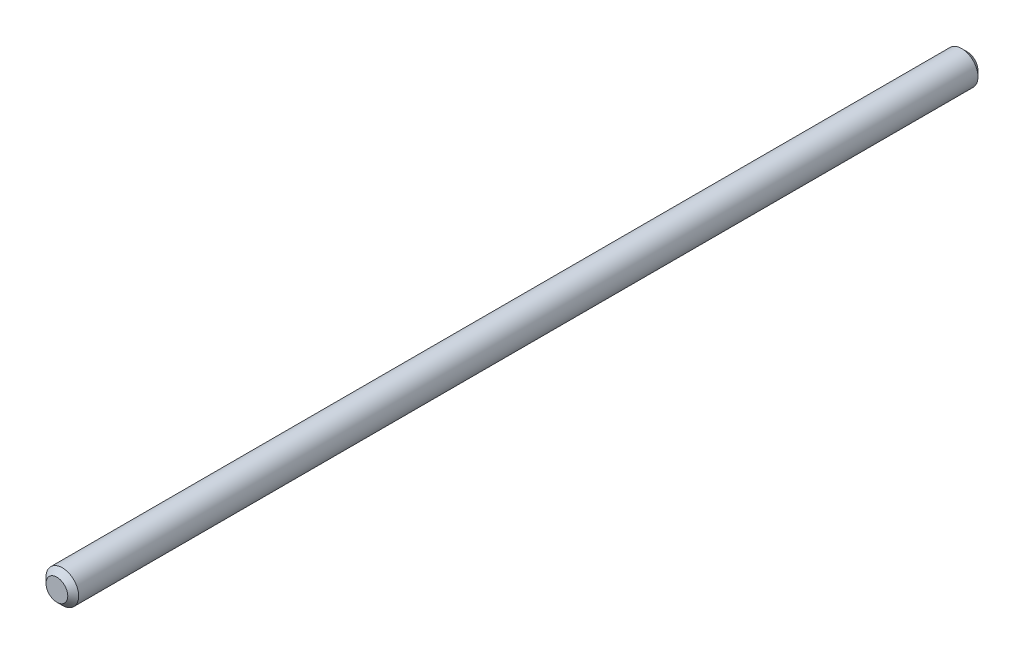
ISO-10303-21;
HEADER;
FILE_DESCRIPTION(('STEP AP214'),'2;1');
FILE_NAME('part.step','',(''),(''),'','','');
FILE_SCHEMA(('AUTOMOTIVE_DESIGN { 1 0 10303 214 1 1 1 1 }'));
ENDSEC;
DATA;
#1=APPLICATION_CONTEXT('core data for automotive mechanical design processes');
#2=APPLICATION_PROTOCOL_DEFINITION('international standard','automotive_design',2000,#1);
#3=PRODUCT_CONTEXT('',#1,'mechanical');
#4=PRODUCT('Part','Part','',(#3));
#5=PRODUCT_RELATED_PRODUCT_CATEGORY('part','',(#4));
#6=PRODUCT_DEFINITION_FORMATION('','',#4);
#7=PRODUCT_DEFINITION_CONTEXT('part definition',#1,'design');
#8=PRODUCT_DEFINITION('design','',#6,#7);
#9=PRODUCT_DEFINITION_SHAPE('','',#8);
#10=(LENGTH_UNIT() NAMED_UNIT(*) SI_UNIT(.MILLI.,.METRE.));
#11=(NAMED_UNIT(*) PLANE_ANGLE_UNIT() SI_UNIT($,.RADIAN.));
#12=(NAMED_UNIT(*) SI_UNIT($,.STERADIAN.) SOLID_ANGLE_UNIT());
#13=UNCERTAINTY_MEASURE_WITH_UNIT(LENGTH_MEASURE(1.E-05),#10,'distance_accuracy_value','');
#14=(GEOMETRIC_REPRESENTATION_CONTEXT(3) GLOBAL_UNCERTAINTY_ASSIGNED_CONTEXT((#13)) GLOBAL_UNIT_ASSIGNED_CONTEXT((#10,
#11,#12)) REPRESENTATION_CONTEXT('',''));
#15=CARTESIAN_POINT('',(0.,0.,0.));
#16=DIRECTION('',(0.,0.,1.));
#17=DIRECTION('',(1.,0.,0.));
#18=AXIS2_PLACEMENT_3D('',#15,#16,#17);
#19=CARTESIAN_POINT('',(0.,0.,83.6));
#20=DIRECTION('',(0.,0.,-1.));
#21=DIRECTION('',(-1.,0.,0.));
#22=AXIS2_PLACEMENT_3D('',#19,#20,#21);
#23=CYLINDRICAL_SURFACE('',#22,1.5);
#24=CARTESIAN_POINT('',(0.,0.,0.5));
#25=DIRECTION('',(0.,0.,1.));
#26=DIRECTION('',(1.,0.,0.));
#27=AXIS2_PLACEMENT_3D('',#24,#25,#26);
#28=CIRCLE('',#27,1.5);
#29=CARTESIAN_POINT('',(1.5,0.,0.5));
#30=VERTEX_POINT('',#29);
#31=EDGE_CURVE('E34',#30,#30,#28,.T.);
#32=ORIENTED_EDGE('',*,*,#31,.T.);
#33=EDGE_LOOP('',(#32));
#34=FACE_BOUND('',#33,.T.);
#35=CARTESIAN_POINT('',(0.,0.,83.1));
#36=DIRECTION('',(0.,0.,1.));
#37=DIRECTION('',(1.,0.,0.));
#38=AXIS2_PLACEMENT_3D('',#35,#36,#37);
#39=CIRCLE('',#38,1.5);
#40=CARTESIAN_POINT('',(1.5,0.,83.1));
#41=VERTEX_POINT('',#40);
#42=EDGE_CURVE('E38',#41,#41,#39,.F.);
#43=ORIENTED_EDGE('',*,*,#42,.T.);
#44=EDGE_LOOP('',(#43));
#45=FACE_BOUND('',#44,.T.);
#46=ADVANCED_FACE('F24',(#34,#45),#23,.T.);
#47=CARTESIAN_POINT('',(0.,0.,83.6));
#48=DIRECTION('',(0.,0.,1.));
#49=DIRECTION('',(1.,0.,0.));
#50=AXIS2_PLACEMENT_3D('',#47,#48,#49);
#51=PLANE('',#50);
#52=CARTESIAN_POINT('',(0.,0.,83.6));
#53=DIRECTION('',(0.,0.,1.));
#54=DIRECTION('',(1.,0.,0.));
#55=AXIS2_PLACEMENT_3D('',#52,#53,#54);
#56=CIRCLE('',#55,1.);
#57=CARTESIAN_POINT('',(1.,0.,83.6));
#58=VERTEX_POINT('',#57);
#59=EDGE_CURVE('E10',#58,#58,#56,.T.);
#60=ORIENTED_EDGE('',*,*,#59,.T.);
#61=EDGE_LOOP('',(#60));
#62=FACE_BOUND('',#61,.T.);
#63=ADVANCED_FACE('F57',(#62),#51,.T.);
#64=CARTESIAN_POINT('',(0.,0.,0.));
#65=DIRECTION('',(0.,0.,1.));
#66=DIRECTION('',(1.,0.,0.));
#67=AXIS2_PLACEMENT_3D('',#64,#65,#66);
#68=PLANE('',#67);
#69=CARTESIAN_POINT('',(0.,0.,0.));
#70=DIRECTION('',(0.,0.,1.));
#71=DIRECTION('',(1.,0.,0.));
#72=AXIS2_PLACEMENT_3D('',#69,#70,#71);
#73=CIRCLE('',#72,1.);
#74=CARTESIAN_POINT('',(1.,0.,0.));
#75=VERTEX_POINT('',#74);
#76=EDGE_CURVE('E30',#75,#75,#73,.F.);
#77=ORIENTED_EDGE('',*,*,#76,.T.);
#78=EDGE_LOOP('',(#77));
#79=FACE_BOUND('',#78,.T.);
#80=ADVANCED_FACE('F53',(#79),#68,.F.);
#81=CARTESIAN_POINT('',(0.,0.,0.5));
#82=DIRECTION('',(0.,0.,1.));
#83=DIRECTION('',(1.,0.,0.));
#84=AXIS2_PLACEMENT_3D('',#81,#82,#83);
#85=CONICAL_SURFACE('',#84,1.5,0.785398163397446);
#86=ORIENTED_EDGE('',*,*,#76,.F.);
#87=EDGE_LOOP('',(#86));
#88=FACE_BOUND('',#87,.T.);
#89=ORIENTED_EDGE('',*,*,#31,.F.);
#90=EDGE_LOOP('',(#89));
#91=FACE_BOUND('',#90,.T.);
#92=ADVANCED_FACE('F48',(#88,#91),#85,.T.);
#93=CARTESIAN_POINT('',(0.,0.,83.6));
#94=DIRECTION('',(0.,0.,-1.));
#95=DIRECTION('',(-1.,0.,0.));
#96=AXIS2_PLACEMENT_3D('',#93,#94,#95);
#97=CONICAL_SURFACE('',#96,1.,0.785398163397449);
#98=ORIENTED_EDGE('',*,*,#42,.F.);
#99=EDGE_LOOP('',(#98));
#100=FACE_BOUND('',#99,.T.);
#101=ORIENTED_EDGE('',*,*,#59,.F.);
#102=EDGE_LOOP('',(#101));
#103=FACE_BOUND('',#102,.T.);
#104=ADVANCED_FACE('F45',(#100,#103),#97,.T.);
#105=CLOSED_SHELL('',(#46,#63,#80,#92,#104));
#106=MANIFOLD_SOLID_BREP('B2',#105);
#107=ADVANCED_BREP_SHAPE_REPRESENTATION('',(#18,#106),#14);
#108=SHAPE_DEFINITION_REPRESENTATION(#9,#107);
ENDSEC;
END-ISO-10303-21;
